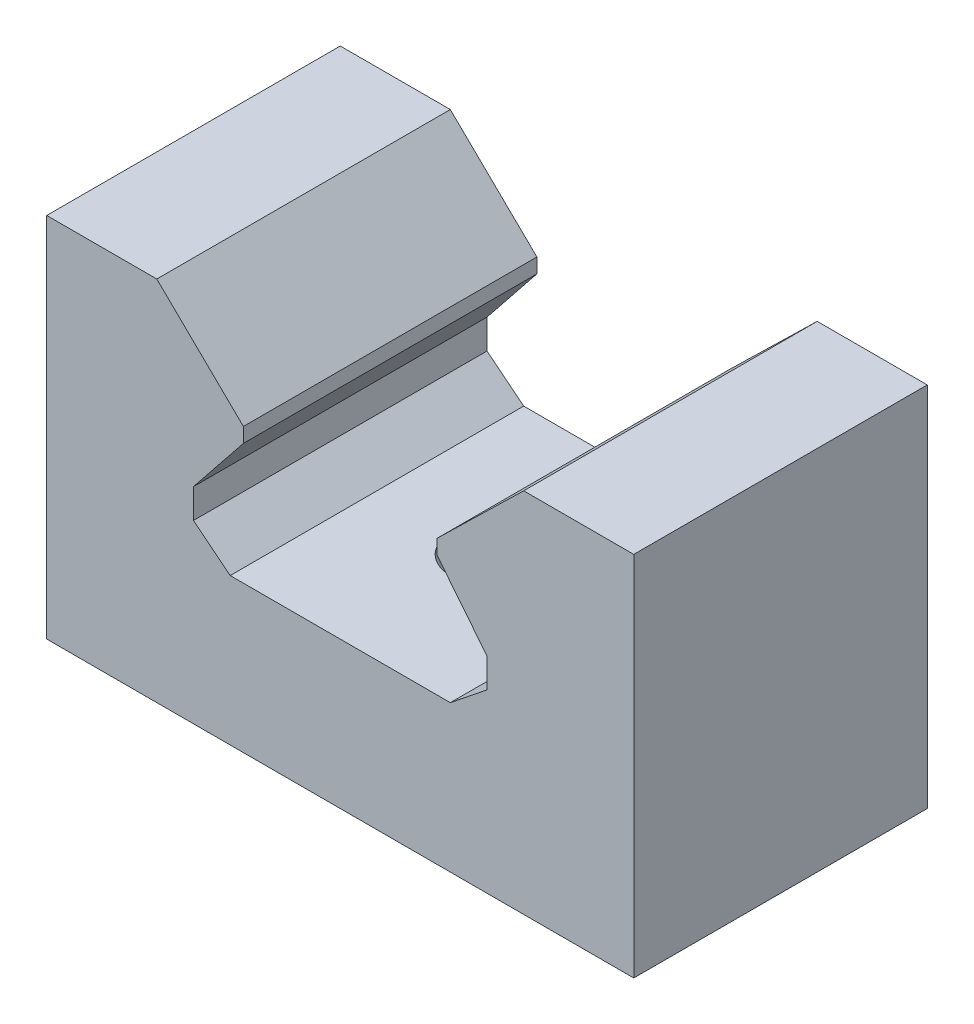
ISO-10303-21;
HEADER;
FILE_DESCRIPTION(('STEP AP214'),'2;1');
FILE_NAME('part.step','',(''),(''),'','','');
FILE_SCHEMA(('AUTOMOTIVE_DESIGN { 1 0 10303 214 1 1 1 1 }'));
ENDSEC;
DATA;
#1=APPLICATION_CONTEXT('core data for automotive mechanical design processes');
#2=APPLICATION_PROTOCOL_DEFINITION('international standard','automotive_design',2000,#1);
#3=PRODUCT_CONTEXT('',#1,'mechanical');
#4=PRODUCT('Part','Part','',(#3));
#5=PRODUCT_RELATED_PRODUCT_CATEGORY('part','',(#4));
#6=PRODUCT_DEFINITION_FORMATION('','',#4);
#7=PRODUCT_DEFINITION_CONTEXT('part definition',#1,'design');
#8=PRODUCT_DEFINITION('design','',#6,#7);
#9=PRODUCT_DEFINITION_SHAPE('','',#8);
#10=(LENGTH_UNIT() NAMED_UNIT(*) SI_UNIT(.MILLI.,.METRE.));
#11=(NAMED_UNIT(*) PLANE_ANGLE_UNIT() SI_UNIT($,.RADIAN.));
#12=(NAMED_UNIT(*) SI_UNIT($,.STERADIAN.) SOLID_ANGLE_UNIT());
#13=UNCERTAINTY_MEASURE_WITH_UNIT(LENGTH_MEASURE(1.E-05),#10,'distance_accuracy_value','');
#14=(GEOMETRIC_REPRESENTATION_CONTEXT(3) GLOBAL_UNCERTAINTY_ASSIGNED_CONTEXT((#13)) GLOBAL_UNIT_ASSIGNED_CONTEXT((#10,
#11,#12)) REPRESENTATION_CONTEXT('',''));
#15=CARTESIAN_POINT('',(0.,0.,0.));
#16=DIRECTION('',(0.,0.,1.));
#17=DIRECTION('',(1.,0.,0.));
#18=AXIS2_PLACEMENT_3D('',#15,#16,#17);
#19=CARTESIAN_POINT('',(-20.,12.5,20.));
#20=DIRECTION('',(0.,-1.,0.));
#21=DIRECTION('',(0.,0.,-1.));
#22=AXIS2_PLACEMENT_3D('',#19,#20,#21);
#23=PLANE('',#22);
#24=DIRECTION('',(0.,0.,1.));
#25=VECTOR('',#24,1.);
#26=CARTESIAN_POINT('',(-12.5,12.5,-64.0434422872475));
#27=LINE('',#26,#25);
#28=CARTESIAN_POINT('',(-12.5,12.5,0.));
#29=VERTEX_POINT('',#28);
#30=CARTESIAN_POINT('',(-12.5,12.5,20.));
#31=VERTEX_POINT('',#30);
#32=EDGE_CURVE('E182',#29,#31,#27,.T.);
#33=ORIENTED_EDGE('',*,*,#32,.F.);
#34=DIRECTION('',(-1.,0.,0.));
#35=VECTOR('',#34,1.);
#36=CARTESIAN_POINT('',(-20.,12.5,0.));
#37=LINE('',#36,#35);
#38=CARTESIAN_POINT('',(-20.,12.5,0.));
#39=VERTEX_POINT('',#38);
#40=EDGE_CURVE('E161',#29,#39,#37,.T.);
#41=ORIENTED_EDGE('',*,*,#40,.T.);
#42=DIRECTION('',(0.,0.,-1.));
#43=VECTOR('',#42,1.);
#44=CARTESIAN_POINT('',(-20.,12.5,20.));
#45=LINE('',#44,#43);
#46=CARTESIAN_POINT('',(-20.,12.5,20.));
#47=VERTEX_POINT('',#46);
#48=EDGE_CURVE('E51',#47,#39,#45,.T.);
#49=ORIENTED_EDGE('',*,*,#48,.F.);
#50=DIRECTION('',(-1.,0.,0.));
#51=VECTOR('',#50,1.);
#52=CARTESIAN_POINT('',(-20.,12.5,20.));
#53=LINE('',#52,#51);
#54=EDGE_CURVE('E229',#31,#47,#53,.T.);
#55=ORIENTED_EDGE('',*,*,#54,.F.);
#56=EDGE_LOOP('',(#33,#41,#49,#55));
#57=FACE_BOUND('',#56,.T.);
#58=ADVANCED_FACE('F42',(#57),#23,.F.);
#59=CARTESIAN_POINT('',(20.,12.5,20.));
#60=DIRECTION('',(-1.,0.,0.));
#61=DIRECTION('',(0.,0.,1.));
#62=AXIS2_PLACEMENT_3D('',#59,#60,#61);
#63=PLANE('',#62);
#64=DIRECTION('',(0.,1.,0.));
#65=VECTOR('',#64,1.);
#66=CARTESIAN_POINT('',(20.,12.5,0.));
#67=LINE('',#66,#65);
#68=CARTESIAN_POINT('',(20.,-12.5,0.));
#69=VERTEX_POINT('',#68);
#70=CARTESIAN_POINT('',(20.,12.5,0.));
#71=VERTEX_POINT('',#70);
#72=EDGE_CURVE('E224',#69,#71,#67,.T.);
#73=ORIENTED_EDGE('',*,*,#72,.T.);
#74=DIRECTION('',(0.,0.,-1.));
#75=VECTOR('',#74,1.);
#76=CARTESIAN_POINT('',(20.,12.5,20.));
#77=LINE('',#76,#75);
#78=CARTESIAN_POINT('',(20.,12.5,20.));
#79=VERTEX_POINT('',#78);
#80=EDGE_CURVE('E11',#79,#71,#77,.T.);
#81=ORIENTED_EDGE('',*,*,#80,.F.);
#82=DIRECTION('',(0.,1.,0.));
#83=VECTOR('',#82,1.);
#84=CARTESIAN_POINT('',(20.,12.5,20.));
#85=LINE('',#84,#83);
#86=CARTESIAN_POINT('',(20.,-12.5,20.));
#87=VERTEX_POINT('',#86);
#88=EDGE_CURVE('E225',#87,#79,#85,.T.);
#89=ORIENTED_EDGE('',*,*,#88,.F.);
#90=DIRECTION('',(0.,0.,-1.));
#91=VECTOR('',#90,1.);
#92=CARTESIAN_POINT('',(20.,-12.5,20.));
#93=LINE('',#92,#91);
#94=EDGE_CURVE('E240',#87,#69,#93,.T.);
#95=ORIENTED_EDGE('',*,*,#94,.T.);
#96=EDGE_LOOP('',(#73,#81,#89,#95));
#97=FACE_BOUND('',#96,.T.);
#98=ADVANCED_FACE('F44',(#97),#63,.F.);
#99=CARTESIAN_POINT('',(12.5,12.5,0.));
#100=VERTEX_POINT('',#99);
#101=EDGE_CURVE('E244',#71,#100,#37,.T.);
#102=ORIENTED_EDGE('',*,*,#101,.T.);
#103=DIRECTION('',(0.,0.,1.));
#104=VECTOR('',#103,1.);
#105=CARTESIAN_POINT('',(12.5,12.5,-64.0434422872475));
#106=LINE('',#105,#104);
#107=CARTESIAN_POINT('',(12.5,12.5,20.));
#108=VERTEX_POINT('',#107);
#109=EDGE_CURVE('E221',#100,#108,#106,.T.);
#110=ORIENTED_EDGE('',*,*,#109,.T.);
#111=EDGE_CURVE('E231',#79,#108,#53,.T.);
#112=ORIENTED_EDGE('',*,*,#111,.F.);
#113=ORIENTED_EDGE('',*,*,#80,.T.);
#114=EDGE_LOOP('',(#102,#110,#112,#113));
#115=FACE_BOUND('',#114,.T.);
#116=ADVANCED_FACE('F281',(#115),#23,.F.);
#117=CARTESIAN_POINT('',(-20.,12.5,20.));
#118=DIRECTION('',(1.,0.,0.));
#119=DIRECTION('',(0.,0.,-1.));
#120=AXIS2_PLACEMENT_3D('',#117,#118,#119);
#121=PLANE('',#120);
#122=DIRECTION('',(0.,-1.,0.));
#123=VECTOR('',#122,1.);
#124=CARTESIAN_POINT('',(-20.,12.5,0.));
#125=LINE('',#124,#123);
#126=CARTESIAN_POINT('',(-20.,-12.5,0.));
#127=VERTEX_POINT('',#126);
#128=EDGE_CURVE('E248',#39,#127,#125,.T.);
#129=ORIENTED_EDGE('',*,*,#128,.T.);
#130=DIRECTION('',(0.,0.,-1.));
#131=VECTOR('',#130,1.);
#132=CARTESIAN_POINT('',(-20.,-12.5,20.));
#133=LINE('',#132,#131);
#134=CARTESIAN_POINT('',(-20.,-12.5,20.));
#135=VERTEX_POINT('',#134);
#136=EDGE_CURVE('E256',#135,#127,#133,.T.);
#137=ORIENTED_EDGE('',*,*,#136,.F.);
#138=DIRECTION('',(0.,-1.,0.));
#139=VECTOR('',#138,1.);
#140=CARTESIAN_POINT('',(-20.,12.5,20.));
#141=LINE('',#140,#139);
#142=EDGE_CURVE('E234',#47,#135,#141,.T.);
#143=ORIENTED_EDGE('',*,*,#142,.F.);
#144=ORIENTED_EDGE('',*,*,#48,.T.);
#145=EDGE_LOOP('',(#129,#137,#143,#144));
#146=FACE_BOUND('',#145,.T.);
#147=ADVANCED_FACE('F264',(#146),#121,.F.);
#148=CARTESIAN_POINT('',(-20.,-12.5,20.));
#149=DIRECTION('',(0.,1.,0.));
#150=DIRECTION('',(0.,0.,1.));
#151=AXIS2_PLACEMENT_3D('',#148,#149,#150);
#152=PLANE('',#151);
#153=CARTESIAN_POINT('',(0.,-12.5,10.));
#154=DIRECTION('',(0.,-1.,0.));
#155=DIRECTION('',(0.,0.,-1.));
#156=AXIS2_PLACEMENT_3D('',#153,#154,#155);
#157=CIRCLE('',#156,2.5);
#158=CARTESIAN_POINT('',(0.,-12.5,7.5));
#159=VERTEX_POINT('',#158);
#160=EDGE_CURVE('E411',#159,#159,#157,.T.);
#161=ORIENTED_EDGE('',*,*,#160,.F.);
#162=EDGE_LOOP('',(#161));
#163=FACE_BOUND('',#162,.T.);
#164=DIRECTION('',(1.,0.,0.));
#165=VECTOR('',#164,1.);
#166=CARTESIAN_POINT('',(-20.,-12.5,0.));
#167=LINE('',#166,#165);
#168=EDGE_CURVE('E230',#127,#69,#167,.T.);
#169=ORIENTED_EDGE('',*,*,#168,.T.);
#170=ORIENTED_EDGE('',*,*,#94,.F.);
#171=DIRECTION('',(1.,0.,0.));
#172=VECTOR('',#171,1.);
#173=CARTESIAN_POINT('',(-20.,-12.5,20.));
#174=LINE('',#173,#172);
#175=EDGE_CURVE('E237',#135,#87,#174,.T.);
#176=ORIENTED_EDGE('',*,*,#175,.F.);
#177=ORIENTED_EDGE('',*,*,#136,.T.);
#178=EDGE_LOOP('',(#169,#170,#176,#177));
#179=FACE_BOUND('',#178,.T.);
#180=ADVANCED_FACE('F272',(#163,#179),#152,.F.);
#181=CARTESIAN_POINT('',(0.,0.,20.));
#182=DIRECTION('',(0.,0.,1.));
#183=DIRECTION('',(1.,0.,0.));
#184=AXIS2_PLACEMENT_3D('',#181,#182,#183);
#185=PLANE('',#184);
#186=DIRECTION('',(0.716151801181329,0.697944551998752,0.));
#187=VECTOR('',#186,1.);
#188=CARTESIAN_POINT('',(6.6,6.75000000000001,20.));
#189=LINE('',#188,#187);
#190=CARTESIAN_POINT('',(6.6,6.75000000000001,20.));
#191=VERTEX_POINT('',#190);
#192=EDGE_CURVE('E58',#191,#108,#189,.T.);
#193=ORIENTED_EDGE('',*,*,#192,.F.);
#194=DIRECTION('',(0.,1.,0.));
#195=VECTOR('',#194,1.);
#196=CARTESIAN_POINT('',(6.6,5.75000000000001,20.));
#197=LINE('',#196,#195);
#198=CARTESIAN_POINT('',(6.6,5.75000000000001,20.));
#199=VERTEX_POINT('',#198);
#200=EDGE_CURVE('E62',#199,#191,#197,.T.);
#201=ORIENTED_EDGE('',*,*,#200,.F.);
#202=DIRECTION('',(-0.624695047554424,0.780868809443031,0.));
#203=VECTOR('',#202,1.);
#204=CARTESIAN_POINT('',(10.,1.5,20.));
#205=LINE('',#204,#203);
#206=CARTESIAN_POINT('',(10.,1.5,20.));
#207=VERTEX_POINT('',#206);
#208=EDGE_CURVE('E300',#207,#199,#205,.T.);
#209=ORIENTED_EDGE('',*,*,#208,.F.);
#210=DIRECTION('',(0.,1.,0.));
#211=VECTOR('',#210,1.);
#212=CARTESIAN_POINT('',(10.,-0.499999999999995,20.));
#213=LINE('',#212,#211);
#214=CARTESIAN_POINT('',(10.,-0.499999999999996,20.));
#215=VERTEX_POINT('',#214);
#216=EDGE_CURVE('E331',#215,#207,#213,.T.);
#217=ORIENTED_EDGE('',*,*,#216,.F.);
#218=DIRECTION('',(0.78086880944303,0.624695047554424,0.));
#219=VECTOR('',#218,1.);
#220=CARTESIAN_POINT('',(7.5,-2.5,20.));
#221=LINE('',#220,#219);
#222=CARTESIAN_POINT('',(7.5,-2.5,20.));
#223=VERTEX_POINT('',#222);
#224=EDGE_CURVE('E327',#223,#215,#221,.T.);
#225=ORIENTED_EDGE('',*,*,#224,.F.);
#226=DIRECTION('',(1.,0.,0.));
#227=VECTOR('',#226,1.);
#228=CARTESIAN_POINT('',(7.5,-2.5,20.));
#229=LINE('',#228,#227);
#230=CARTESIAN_POINT('',(-7.5,-2.49999999999999,20.));
#231=VERTEX_POINT('',#230);
#232=EDGE_CURVE('E323',#231,#223,#229,.T.);
#233=ORIENTED_EDGE('',*,*,#232,.F.);
#234=DIRECTION('',(0.780868809443031,-0.624695047554424,0.));
#235=VECTOR('',#234,1.);
#236=CARTESIAN_POINT('',(-7.5,-2.49999999999999,20.));
#237=LINE('',#236,#235);
#238=CARTESIAN_POINT('',(-10.,-0.499999999999995,20.));
#239=VERTEX_POINT('',#238);
#240=EDGE_CURVE('E319',#239,#231,#237,.T.);
#241=ORIENTED_EDGE('',*,*,#240,.F.);
#242=DIRECTION('',(0.,-1.,0.));
#243=VECTOR('',#242,1.);
#244=CARTESIAN_POINT('',(-10.,-0.499999999999995,20.));
#245=LINE('',#244,#243);
#246=CARTESIAN_POINT('',(-10.,1.5,20.));
#247=VERTEX_POINT('',#246);
#248=EDGE_CURVE('E315',#247,#239,#245,.T.);
#249=ORIENTED_EDGE('',*,*,#248,.F.);
#250=DIRECTION('',(-0.624695047554424,-0.780868809443031,0.));
#251=VECTOR('',#250,1.);
#252=CARTESIAN_POINT('',(-10.,1.5,20.));
#253=LINE('',#252,#251);
#254=CARTESIAN_POINT('',(-6.6,5.75000000000001,20.));
#255=VERTEX_POINT('',#254);
#256=EDGE_CURVE('E311',#255,#247,#253,.T.);
#257=ORIENTED_EDGE('',*,*,#256,.F.);
#258=DIRECTION('',(0.,-1.,0.));
#259=VECTOR('',#258,1.);
#260=CARTESIAN_POINT('',(-6.6,5.75000000000001,20.));
#261=LINE('',#260,#259);
#262=CARTESIAN_POINT('',(-6.6,6.75000000000001,20.));
#263=VERTEX_POINT('',#262);
#264=EDGE_CURVE('E308',#263,#255,#261,.T.);
#265=ORIENTED_EDGE('',*,*,#264,.F.);
#266=DIRECTION('',(0.716151801181329,-0.697944551998752,0.));
#267=VECTOR('',#266,1.);
#268=CARTESIAN_POINT('',(-6.6,6.75000000000001,20.));
#269=LINE('',#268,#267);
#270=EDGE_CURVE('E166',#31,#263,#269,.T.);
#271=ORIENTED_EDGE('',*,*,#270,.F.);
#272=ORIENTED_EDGE('',*,*,#54,.T.);
#273=ORIENTED_EDGE('',*,*,#142,.T.);
#274=ORIENTED_EDGE('',*,*,#175,.T.);
#275=ORIENTED_EDGE('',*,*,#88,.T.);
#276=ORIENTED_EDGE('',*,*,#111,.T.);
#277=EDGE_LOOP('',(#193,#201,#209,#217,#225,#233,#241,#249,#257,#265,#271,#272,#273,#274,#275,#276));
#278=FACE_BOUND('',#277,.T.);
#279=ADVANCED_FACE('F277',(#278),#185,.T.);
#280=CARTESIAN_POINT('',(0.,0.,0.));
#281=DIRECTION('',(0.,0.,1.));
#282=DIRECTION('',(1.,0.,0.));
#283=AXIS2_PLACEMENT_3D('',#280,#281,#282);
#284=PLANE('',#283);
#285=DIRECTION('',(0.,1.,0.));
#286=VECTOR('',#285,1.);
#287=CARTESIAN_POINT('',(6.6,5.75000000000001,0.));
#288=LINE('',#287,#286);
#289=CARTESIAN_POINT('',(6.6,5.75000000000001,0.));
#290=VERTEX_POINT('',#289);
#291=CARTESIAN_POINT('',(6.6,6.75000000000001,0.));
#292=VERTEX_POINT('',#291);
#293=EDGE_CURVE('E339',#290,#292,#288,.T.);
#294=ORIENTED_EDGE('',*,*,#293,.T.);
#295=DIRECTION('',(0.716151801181329,0.697944551998752,0.));
#296=VECTOR('',#295,1.);
#297=CARTESIAN_POINT('',(6.6,6.75000000000001,0.));
#298=LINE('',#297,#296);
#299=EDGE_CURVE('E295',#292,#100,#298,.T.);
#300=ORIENTED_EDGE('',*,*,#299,.T.);
#301=ORIENTED_EDGE('',*,*,#101,.F.);
#302=ORIENTED_EDGE('',*,*,#72,.F.);
#303=ORIENTED_EDGE('',*,*,#168,.F.);
#304=ORIENTED_EDGE('',*,*,#128,.F.);
#305=ORIENTED_EDGE('',*,*,#40,.F.);
#306=DIRECTION('',(0.716151801181329,-0.697944551998752,0.));
#307=VECTOR('',#306,1.);
#308=CARTESIAN_POINT('',(-6.6,6.75000000000001,0.));
#309=LINE('',#308,#307);
#310=CARTESIAN_POINT('',(-6.6,6.75000000000001,0.));
#311=VERTEX_POINT('',#310);
#312=EDGE_CURVE('E155',#29,#311,#309,.T.);
#313=ORIENTED_EDGE('',*,*,#312,.T.);
#314=DIRECTION('',(0.,-1.,0.));
#315=VECTOR('',#314,1.);
#316=CARTESIAN_POINT('',(-6.6,5.75000000000001,0.));
#317=LINE('',#316,#315);
#318=CARTESIAN_POINT('',(-6.6,5.75000000000001,0.));
#319=VERTEX_POINT('',#318);
#320=EDGE_CURVE('E158',#311,#319,#317,.T.);
#321=ORIENTED_EDGE('',*,*,#320,.T.);
#322=DIRECTION('',(-0.624695047554424,-0.780868809443031,0.));
#323=VECTOR('',#322,1.);
#324=CARTESIAN_POINT('',(-10.,1.5,0.));
#325=LINE('',#324,#323);
#326=CARTESIAN_POINT('',(-10.,1.5,0.));
#327=VERTEX_POINT('',#326);
#328=EDGE_CURVE('E177',#319,#327,#325,.T.);
#329=ORIENTED_EDGE('',*,*,#328,.T.);
#330=DIRECTION('',(0.,-1.,0.));
#331=VECTOR('',#330,1.);
#332=CARTESIAN_POINT('',(-10.,-0.499999999999995,0.));
#333=LINE('',#332,#331);
#334=CARTESIAN_POINT('',(-10.,-0.499999999999995,0.));
#335=VERTEX_POINT('',#334);
#336=EDGE_CURVE('E357',#327,#335,#333,.T.);
#337=ORIENTED_EDGE('',*,*,#336,.T.);
#338=DIRECTION('',(0.780868809443031,-0.624695047554424,0.));
#339=VECTOR('',#338,1.);
#340=CARTESIAN_POINT('',(-7.5,-2.49999999999999,0.));
#341=LINE('',#340,#339);
#342=CARTESIAN_POINT('',(-7.5,-2.49999999999999,0.));
#343=VERTEX_POINT('',#342);
#344=EDGE_CURVE('E354',#335,#343,#341,.T.);
#345=ORIENTED_EDGE('',*,*,#344,.T.);
#346=DIRECTION('',(1.,0.,0.));
#347=VECTOR('',#346,1.);
#348=CARTESIAN_POINT('',(7.5,-2.5,0.));
#349=LINE('',#348,#347);
#350=CARTESIAN_POINT('',(7.5,-2.5,0.));
#351=VERTEX_POINT('',#350);
#352=EDGE_CURVE('E351',#343,#351,#349,.T.);
#353=ORIENTED_EDGE('',*,*,#352,.T.);
#354=DIRECTION('',(0.78086880944303,0.624695047554424,0.));
#355=VECTOR('',#354,1.);
#356=CARTESIAN_POINT('',(7.5,-2.5,0.));
#357=LINE('',#356,#355);
#358=CARTESIAN_POINT('',(10.,-0.499999999999996,0.));
#359=VERTEX_POINT('',#358);
#360=EDGE_CURVE('E348',#351,#359,#357,.T.);
#361=ORIENTED_EDGE('',*,*,#360,.T.);
#362=DIRECTION('',(0.,1.,0.));
#363=VECTOR('',#362,1.);
#364=CARTESIAN_POINT('',(10.,-0.499999999999995,0.));
#365=LINE('',#364,#363);
#366=CARTESIAN_POINT('',(10.,1.5,0.));
#367=VERTEX_POINT('',#366);
#368=EDGE_CURVE('E345',#359,#367,#365,.T.);
#369=ORIENTED_EDGE('',*,*,#368,.T.);
#370=DIRECTION('',(-0.624695047554424,0.780868809443031,0.));
#371=VECTOR('',#370,1.);
#372=CARTESIAN_POINT('',(10.,1.5,0.));
#373=LINE('',#372,#371);
#374=EDGE_CURVE('E342',#367,#290,#373,.T.);
#375=ORIENTED_EDGE('',*,*,#374,.T.);
#376=EDGE_LOOP('',(#294,#300,#301,#302,#303,#304,#305,#313,#321,#329,#337,#345,#353,#361,#369,#375));
#377=FACE_BOUND('',#376,.T.);
#378=ADVANCED_FACE('F157',(#377),#284,.F.);
#379=CARTESIAN_POINT('',(6.6,6.75000000000001,-64.0434422872475));
#380=DIRECTION('',(-0.697944551998752,0.716151801181329,0.));
#381=DIRECTION('',(-0.716151801181329,-0.697944551998752,0.));
#382=AXIS2_PLACEMENT_3D('',#379,#380,#381);
#383=PLANE('',#382);
#384=ORIENTED_EDGE('',*,*,#299,.F.);
#385=DIRECTION('',(0.,0.,1.));
#386=VECTOR('',#385,1.);
#387=CARTESIAN_POINT('',(6.6,6.75000000000001,-64.0434422872475));
#388=LINE('',#387,#386);
#389=EDGE_CURVE('E217',#292,#191,#388,.T.);
#390=ORIENTED_EDGE('',*,*,#389,.T.);
#391=ORIENTED_EDGE('',*,*,#192,.T.);
#392=ORIENTED_EDGE('',*,*,#109,.F.);
#393=EDGE_LOOP('',(#384,#390,#391,#392));
#394=FACE_BOUND('',#393,.T.);
#395=ADVANCED_FACE('F294',(#394),#383,.T.);
#396=CARTESIAN_POINT('',(6.6,5.75000000000001,-64.0434422872475));
#397=DIRECTION('',(-1.,0.,0.));
#398=DIRECTION('',(0.,0.,1.));
#399=AXIS2_PLACEMENT_3D('',#396,#397,#398);
#400=PLANE('',#399);
#401=ORIENTED_EDGE('',*,*,#293,.F.);
#402=DIRECTION('',(0.,0.,1.));
#403=VECTOR('',#402,1.);
#404=CARTESIAN_POINT('',(6.6,5.75000000000001,-64.0434422872475));
#405=LINE('',#404,#403);
#406=EDGE_CURVE('E213',#290,#199,#405,.T.);
#407=ORIENTED_EDGE('',*,*,#406,.T.);
#408=ORIENTED_EDGE('',*,*,#200,.T.);
#409=ORIENTED_EDGE('',*,*,#389,.F.);
#410=EDGE_LOOP('',(#401,#407,#408,#409));
#411=FACE_BOUND('',#410,.T.);
#412=ADVANCED_FACE('F390',(#411),#400,.T.);
#413=CARTESIAN_POINT('',(10.,1.5,-64.0434422872475));
#414=DIRECTION('',(-0.780868809443031,-0.624695047554424,0.));
#415=DIRECTION('',(0.624695047554424,-0.780868809443031,0.));
#416=AXIS2_PLACEMENT_3D('',#413,#414,#415);
#417=PLANE('',#416);
#418=ORIENTED_EDGE('',*,*,#374,.F.);
#419=DIRECTION('',(0.,0.,1.));
#420=VECTOR('',#419,1.);
#421=CARTESIAN_POINT('',(10.,1.5,-64.0434422872475));
#422=LINE('',#421,#420);
#423=EDGE_CURVE('E209',#367,#207,#422,.T.);
#424=ORIENTED_EDGE('',*,*,#423,.T.);
#425=ORIENTED_EDGE('',*,*,#208,.T.);
#426=ORIENTED_EDGE('',*,*,#406,.F.);
#427=EDGE_LOOP('',(#418,#424,#425,#426));
#428=FACE_BOUND('',#427,.T.);
#429=ADVANCED_FACE('F386',(#428),#417,.T.);
#430=CARTESIAN_POINT('',(10.,-0.499999999999995,-64.0434422872475));
#431=DIRECTION('',(-1.,0.,0.));
#432=DIRECTION('',(0.,0.,1.));
#433=AXIS2_PLACEMENT_3D('',#430,#431,#432);
#434=PLANE('',#433);
#435=ORIENTED_EDGE('',*,*,#368,.F.);
#436=DIRECTION('',(0.,0.,1.));
#437=VECTOR('',#436,1.);
#438=CARTESIAN_POINT('',(10.,-0.499999999999995,-64.0434422872475));
#439=LINE('',#438,#437);
#440=EDGE_CURVE('E205',#359,#215,#439,.T.);
#441=ORIENTED_EDGE('',*,*,#440,.T.);
#442=ORIENTED_EDGE('',*,*,#216,.T.);
#443=ORIENTED_EDGE('',*,*,#423,.F.);
#444=EDGE_LOOP('',(#435,#441,#442,#443));
#445=FACE_BOUND('',#444,.T.);
#446=ADVANCED_FACE('F384',(#445),#434,.T.);
#447=CARTESIAN_POINT('',(7.5,-2.5,-64.0434422872475));
#448=DIRECTION('',(-0.624695047554424,0.78086880944303,0.));
#449=DIRECTION('',(-0.78086880944303,-0.624695047554424,0.));
#450=AXIS2_PLACEMENT_3D('',#447,#448,#449);
#451=PLANE('',#450);
#452=ORIENTED_EDGE('',*,*,#360,.F.);
#453=DIRECTION('',(0.,0.,1.));
#454=VECTOR('',#453,1.);
#455=CARTESIAN_POINT('',(7.5,-2.5,-64.0434422872475));
#456=LINE('',#455,#454);
#457=EDGE_CURVE('E201',#351,#223,#456,.T.);
#458=ORIENTED_EDGE('',*,*,#457,.T.);
#459=ORIENTED_EDGE('',*,*,#224,.T.);
#460=ORIENTED_EDGE('',*,*,#440,.F.);
#461=EDGE_LOOP('',(#452,#458,#459,#460));
#462=FACE_BOUND('',#461,.T.);
#463=ADVANCED_FACE('F378',(#462),#451,.T.);
#464=CARTESIAN_POINT('',(7.5,-2.5,-64.0434422872475));
#465=DIRECTION('',(0.,1.,0.));
#466=DIRECTION('',(-1.,0.,0.));
#467=AXIS2_PLACEMENT_3D('',#464,#465,#466);
#468=PLANE('',#467);
#469=CARTESIAN_POINT('',(0.,-2.5,10.));
#470=DIRECTION('',(0.,1.,0.));
#471=DIRECTION('',(-1.,0.,0.));
#472=AXIS2_PLACEMENT_3D('',#469,#470,#471);
#473=CIRCLE('',#472,2.5);
#474=CARTESIAN_POINT('',(-2.5,-2.49999999999999,10.));
#475=VERTEX_POINT('',#474);
#476=EDGE_CURVE('E304',#475,#475,#473,.T.);
#477=ORIENTED_EDGE('',*,*,#476,.F.);
#478=EDGE_LOOP('',(#477));
#479=FACE_BOUND('',#478,.T.);
#480=ORIENTED_EDGE('',*,*,#352,.F.);
#481=DIRECTION('',(0.,0.,1.));
#482=VECTOR('',#481,1.);
#483=CARTESIAN_POINT('',(-7.5,-2.49999999999999,-64.0434422872475));
#484=LINE('',#483,#482);
#485=EDGE_CURVE('E197',#343,#231,#484,.T.);
#486=ORIENTED_EDGE('',*,*,#485,.T.);
#487=ORIENTED_EDGE('',*,*,#232,.T.);
#488=ORIENTED_EDGE('',*,*,#457,.F.);
#489=EDGE_LOOP('',(#480,#486,#487,#488));
#490=FACE_BOUND('',#489,.T.);
#491=ADVANCED_FACE('F376',(#479,#490),#468,.T.);
#492=CARTESIAN_POINT('',(-7.5,-2.49999999999999,-64.0434422872475));
#493=DIRECTION('',(0.624695047554424,0.780868809443031,0.));
#494=DIRECTION('',(-0.780868809443031,0.624695047554424,0.));
#495=AXIS2_PLACEMENT_3D('',#492,#493,#494);
#496=PLANE('',#495);
#497=ORIENTED_EDGE('',*,*,#344,.F.);
#498=DIRECTION('',(0.,0.,1.));
#499=VECTOR('',#498,1.);
#500=CARTESIAN_POINT('',(-10.,-0.499999999999995,-64.0434422872475));
#501=LINE('',#500,#499);
#502=EDGE_CURVE('E193',#335,#239,#501,.T.);
#503=ORIENTED_EDGE('',*,*,#502,.T.);
#504=ORIENTED_EDGE('',*,*,#240,.T.);
#505=ORIENTED_EDGE('',*,*,#485,.F.);
#506=EDGE_LOOP('',(#497,#503,#504,#505));
#507=FACE_BOUND('',#506,.T.);
#508=ADVANCED_FACE('F370',(#507),#496,.T.);
#509=CARTESIAN_POINT('',(-10.,-0.499999999999995,-64.0434422872475));
#510=DIRECTION('',(1.,0.,0.));
#511=DIRECTION('',(0.,0.,-1.));
#512=AXIS2_PLACEMENT_3D('',#509,#510,#511);
#513=PLANE('',#512);
#514=ORIENTED_EDGE('',*,*,#336,.F.);
#515=DIRECTION('',(0.,0.,1.));
#516=VECTOR('',#515,1.);
#517=CARTESIAN_POINT('',(-10.,1.5,-64.0434422872475));
#518=LINE('',#517,#516);
#519=EDGE_CURVE('E186',#327,#247,#518,.T.);
#520=ORIENTED_EDGE('',*,*,#519,.T.);
#521=ORIENTED_EDGE('',*,*,#248,.T.);
#522=ORIENTED_EDGE('',*,*,#502,.F.);
#523=EDGE_LOOP('',(#514,#520,#521,#522));
#524=FACE_BOUND('',#523,.T.);
#525=ADVANCED_FACE('F367',(#524),#513,.T.);
#526=CARTESIAN_POINT('',(-10.,1.5,-64.0434422872475));
#527=DIRECTION('',(0.780868809443031,-0.624695047554424,0.));
#528=DIRECTION('',(0.624695047554424,0.780868809443031,0.));
#529=AXIS2_PLACEMENT_3D('',#526,#527,#528);
#530=PLANE('',#529);
#531=ORIENTED_EDGE('',*,*,#328,.F.);
#532=DIRECTION('',(0.,0.,1.));
#533=VECTOR('',#532,1.);
#534=CARTESIAN_POINT('',(-6.6,5.75000000000001,-64.0434422872475));
#535=LINE('',#534,#533);
#536=EDGE_CURVE('E175',#319,#255,#535,.T.);
#537=ORIENTED_EDGE('',*,*,#536,.T.);
#538=ORIENTED_EDGE('',*,*,#256,.T.);
#539=ORIENTED_EDGE('',*,*,#519,.F.);
#540=EDGE_LOOP('',(#531,#537,#538,#539));
#541=FACE_BOUND('',#540,.T.);
#542=ADVANCED_FACE('F368',(#541),#530,.T.);
#543=CARTESIAN_POINT('',(-6.6,5.75000000000001,-64.0434422872475));
#544=DIRECTION('',(1.,0.,0.));
#545=DIRECTION('',(0.,0.,-1.));
#546=AXIS2_PLACEMENT_3D('',#543,#544,#545);
#547=PLANE('',#546);
#548=ORIENTED_EDGE('',*,*,#320,.F.);
#549=DIRECTION('',(0.,0.,1.));
#550=VECTOR('',#549,1.);
#551=CARTESIAN_POINT('',(-6.6,6.75000000000001,-64.0434422872475));
#552=LINE('',#551,#550);
#553=EDGE_CURVE('E173',#311,#263,#552,.T.);
#554=ORIENTED_EDGE('',*,*,#553,.T.);
#555=ORIENTED_EDGE('',*,*,#264,.T.);
#556=ORIENTED_EDGE('',*,*,#536,.F.);
#557=EDGE_LOOP('',(#548,#554,#555,#556));
#558=FACE_BOUND('',#557,.T.);
#559=ADVANCED_FACE('F171',(#558),#547,.T.);
#560=CARTESIAN_POINT('',(-6.6,6.75000000000001,-64.0434422872475));
#561=DIRECTION('',(0.697944551998752,0.716151801181329,0.));
#562=DIRECTION('',(-0.716151801181329,0.697944551998752,0.));
#563=AXIS2_PLACEMENT_3D('',#560,#561,#562);
#564=PLANE('',#563);
#565=ORIENTED_EDGE('',*,*,#312,.F.);
#566=ORIENTED_EDGE('',*,*,#32,.T.);
#567=ORIENTED_EDGE('',*,*,#270,.T.);
#568=ORIENTED_EDGE('',*,*,#553,.F.);
#569=EDGE_LOOP('',(#565,#566,#567,#568));
#570=FACE_BOUND('',#569,.T.);
#571=ADVANCED_FACE('F180',(#570),#564,.T.);
#572=CARTESIAN_POINT('',(0.,-12.5,10.));
#573=DIRECTION('',(0.,-1.,0.));
#574=DIRECTION('',(0.,0.,-1.));
#575=AXIS2_PLACEMENT_3D('',#572,#573,#574);
#576=CYLINDRICAL_SURFACE('',#575,2.5);
#577=ORIENTED_EDGE('',*,*,#476,.T.);
#578=EDGE_LOOP('',(#577));
#579=FACE_BOUND('',#578,.T.);
#580=ORIENTED_EDGE('',*,*,#160,.T.);
#581=EDGE_LOOP('',(#580));
#582=FACE_BOUND('',#581,.T.);
#583=ADVANCED_FACE('F418',(#579,#582),#576,.F.);
#584=CLOSED_SHELL('',(#58,#98,#116,#147,#180,#279,#378,#395,#412,#429,#446,#463,#491,#508,#525,
#542,#559,#571,#583));
#585=MANIFOLD_SOLID_BREP('B2',#584);
#586=ADVANCED_BREP_SHAPE_REPRESENTATION('',(#18,#585),#14);
#587=SHAPE_DEFINITION_REPRESENTATION(#9,#586);
ENDSEC;
END-ISO-10303-21;
